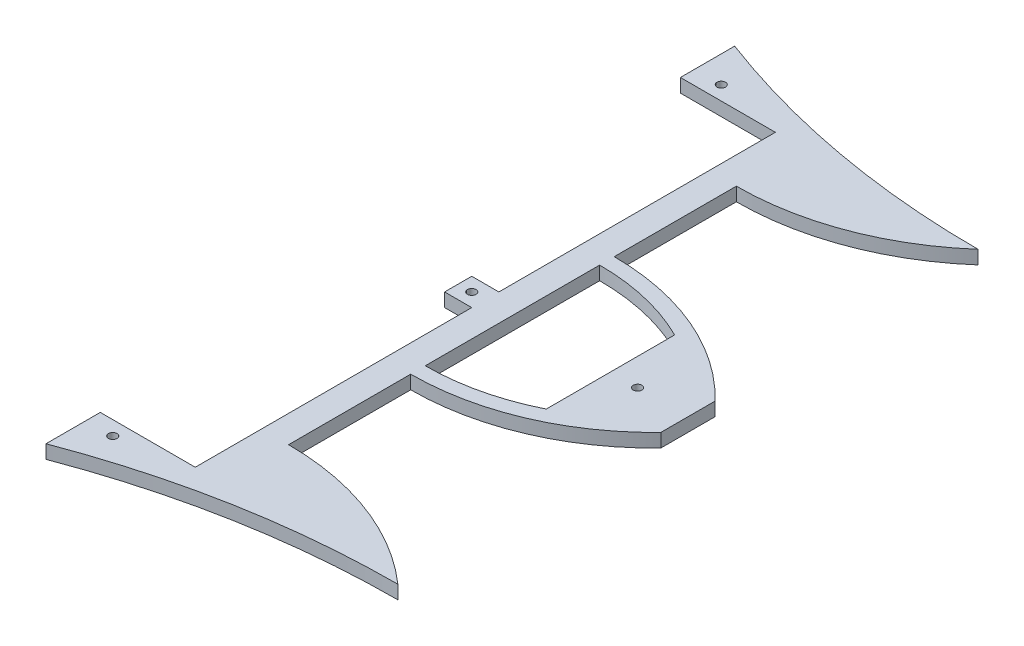
ISO-10303-21;
HEADER;
FILE_DESCRIPTION(('STEP AP214'),'2;1');
FILE_NAME('part.step','',(''),(''),'','','');
FILE_SCHEMA(('AUTOMOTIVE_DESIGN { 1 0 10303 214 1 1 1 1 }'));
ENDSEC;
DATA;
#1=APPLICATION_CONTEXT('core data for automotive mechanical design processes');
#2=APPLICATION_PROTOCOL_DEFINITION('international standard','automotive_design',2000,#1);
#3=PRODUCT_CONTEXT('',#1,'mechanical');
#4=PRODUCT('Part','Part','',(#3));
#5=PRODUCT_RELATED_PRODUCT_CATEGORY('part','',(#4));
#6=PRODUCT_DEFINITION_FORMATION('','',#4);
#7=PRODUCT_DEFINITION_CONTEXT('part definition',#1,'design');
#8=PRODUCT_DEFINITION('design','',#6,#7);
#9=PRODUCT_DEFINITION_SHAPE('','',#8);
#10=(LENGTH_UNIT() NAMED_UNIT(*) SI_UNIT(.MILLI.,.METRE.));
#11=(NAMED_UNIT(*) PLANE_ANGLE_UNIT() SI_UNIT($,.RADIAN.));
#12=(NAMED_UNIT(*) SI_UNIT($,.STERADIAN.) SOLID_ANGLE_UNIT());
#13=UNCERTAINTY_MEASURE_WITH_UNIT(LENGTH_MEASURE(1.E-05),#10,'distance_accuracy_value','');
#14=(GEOMETRIC_REPRESENTATION_CONTEXT(3) GLOBAL_UNCERTAINTY_ASSIGNED_CONTEXT((#13)) GLOBAL_UNIT_ASSIGNED_CONTEXT((#10,
#11,#12)) REPRESENTATION_CONTEXT('',''));
#15=CARTESIAN_POINT('',(0.,0.,0.));
#16=DIRECTION('',(0.,0.,1.));
#17=DIRECTION('',(1.,0.,0.));
#18=AXIS2_PLACEMENT_3D('',#15,#16,#17);
#19=CARTESIAN_POINT('',(0.,6.35,0.));
#20=DIRECTION('',(0.,1.,0.));
#21=DIRECTION('',(0.,0.,1.));
#22=AXIS2_PLACEMENT_3D('',#19,#20,#21);
#23=PLANE('',#22);
#24=CARTESIAN_POINT('',(217.303750699543,6.35,0.));
#25=DIRECTION('',(0.,1.,0.));
#26=DIRECTION('',(0.,0.,1.));
#27=AXIS2_PLACEMENT_3D('',#24,#25,#26);
#28=CIRCLE('',#27,2.);
#29=CARTESIAN_POINT('',(217.303750699543,6.35,1.99999999999991));
#30=VERTEX_POINT('',#29);
#31=EDGE_CURVE('E223',#30,#30,#28,.T.);
#32=ORIENTED_EDGE('',*,*,#31,.F.);
#33=EDGE_LOOP('',(#32));
#34=FACE_BOUND('',#33,.T.);
#35=DIRECTION('',(0.,0.,1.));
#36=VECTOR('',#35,1.);
#37=CARTESIAN_POINT('',(158.75,6.35,-5.39827040751267E-13));
#38=LINE('',#37,#36);
#39=CARTESIAN_POINT('',(158.75,6.35,-40.8111978129983));
#40=VERTEX_POINT('',#39);
#41=CARTESIAN_POINT('',(158.75,6.35,40.8111978129983));
#42=VERTEX_POINT('',#41);
#43=EDGE_CURVE('E258',#40,#42,#38,.T.);
#44=ORIENTED_EDGE('',*,*,#43,.F.);
#45=CARTESIAN_POINT('',(158.75,6.35,62.2275055766957));
#46=DIRECTION('',(0.,1.,0.));
#47=DIRECTION('',(0.,0.,1.));
#48=AXIS2_PLACEMENT_3D('',#45,#46,#47);
#49=CIRCLE('',#48,103.038703389694);
#50=CARTESIAN_POINT('',(204.603750699543,6.35,-30.0460439541071));
#51=VERTEX_POINT('',#50);
#52=EDGE_CURVE('E56',#40,#51,#49,.F.);
#53=ORIENTED_EDGE('',*,*,#52,.T.);
#54=DIRECTION('',(0.,0.,1.));
#55=VECTOR('',#54,1.);
#56=CARTESIAN_POINT('',(204.603750699543,6.35,-2.83509613567922E-13));
#57=LINE('',#56,#55);
#58=CARTESIAN_POINT('',(204.603750699543,6.35,30.046043954107));
#59=VERTEX_POINT('',#58);
#60=EDGE_CURVE('E250',#51,#59,#57,.T.);
#61=ORIENTED_EDGE('',*,*,#60,.T.);
#62=CARTESIAN_POINT('',(158.75,6.35,-62.2275055766968));
#63=DIRECTION('',(0.,1.,0.));
#64=DIRECTION('',(0.,0.,1.));
#65=AXIS2_PLACEMENT_3D('',#62,#63,#64);
#66=CIRCLE('',#65,103.038703389695);
#67=EDGE_CURVE('E261',#42,#59,#66,.T.);
#68=ORIENTED_EDGE('',*,*,#67,.F.);
#69=EDGE_LOOP('',(#44,#53,#61,#68));
#70=FACE_BOUND('',#69,.T.);
#71=CARTESIAN_POINT('',(139.7,6.35,-3.40873163029443E-13));
#72=DIRECTION('',(0.,1.,0.));
#73=DIRECTION('',(0.,0.,1.));
#74=AXIS2_PLACEMENT_3D('',#71,#72,#73);
#75=CIRCLE('',#74,2.);
#76=CARTESIAN_POINT('',(139.7,6.35,1.99999999999966));
#77=VERTEX_POINT('',#76);
#78=EDGE_CURVE('E374',#77,#77,#75,.T.);
#79=ORIENTED_EDGE('',*,*,#78,.F.);
#80=EDGE_LOOP('',(#79));
#81=FACE_BOUND('',#80,.T.);
#82=CARTESIAN_POINT('',(114.080664860715,6.35,-142.38147595269));
#83=DIRECTION('',(0.,1.,0.));
#84=DIRECTION('',(0.,0.,1.));
#85=AXIS2_PLACEMENT_3D('',#82,#83,#84);
#86=CIRCLE('',#85,2.);
#87=CARTESIAN_POINT('',(114.080664860715,6.35,-140.38147595269));
#88=VERTEX_POINT('',#87);
#89=EDGE_CURVE('E305',#88,#88,#86,.T.);
#90=ORIENTED_EDGE('',*,*,#89,.F.);
#91=EDGE_LOOP('',(#90));
#92=FACE_BOUND('',#91,.T.);
#93=CARTESIAN_POINT('',(114.080664860715,6.35,142.38147595269));
#94=DIRECTION('',(0.,-1.,0.));
#95=DIRECTION('',(0.,0.,-1.));
#96=AXIS2_PLACEMENT_3D('',#93,#94,#95);
#97=CIRCLE('',#96,2.);
#98=CARTESIAN_POINT('',(114.080664860715,6.35,140.38147595269));
#99=VERTEX_POINT('',#98);
#100=EDGE_CURVE('E277',#99,#99,#97,.T.);
#101=ORIENTED_EDGE('',*,*,#100,.T.);
#102=EDGE_LOOP('',(#101));
#103=FACE_BOUND('',#102,.T.);
#104=CARTESIAN_POINT('',(158.750000000001,6.35,229.151251741856));
#105=DIRECTION('',(0.,1.,0.));
#106=DIRECTION('',(0.,0.,1.));
#107=AXIS2_PLACEMENT_3D('',#104,#105,#106);
#108=CIRCLE('',#107,124.376251741856);
#109=CARTESIAN_POINT('',(158.750000000001,6.35,104.775));
#110=VERTEX_POINT('',#109);
#111=CARTESIAN_POINT('',(240.876195248116,6.35,135.744934763709));
#112=VERTEX_POINT('',#111);
#113=EDGE_CURVE('E218',#110,#112,#108,.F.);
#114=ORIENTED_EDGE('',*,*,#113,.F.);
#115=DIRECTION('',(0.,0.,1.));
#116=VECTOR('',#115,1.);
#117=CARTESIAN_POINT('',(158.75,6.35,0.));
#118=LINE('',#117,#116);
#119=CARTESIAN_POINT('',(158.75,6.35,47.6249999999999));
#120=VERTEX_POINT('',#119);
#121=EDGE_CURVE('E210',#120,#110,#118,.T.);
#122=ORIENTED_EDGE('',*,*,#121,.F.);
#123=CARTESIAN_POINT('',(158.75,6.35,-66.3974419603674));
#124=DIRECTION('',(0.,1.,0.));
#125=DIRECTION('',(0.,0.,1.));
#126=AXIS2_PLACEMENT_3D('',#123,#124,#125);
#127=CIRCLE('',#126,114.022441960367);
#128=CARTESIAN_POINT('',(240.876195248116,6.35,12.7));
#129=VERTEX_POINT('',#128);
#130=EDGE_CURVE('E213',#120,#129,#127,.T.);
#131=ORIENTED_EDGE('',*,*,#130,.T.);
#132=DIRECTION('',(0.,0.,1.));
#133=VECTOR('',#132,1.);
#134=CARTESIAN_POINT('',(240.876195248116,6.35,1.05285944113608E-12));
#135=LINE('',#134,#133);
#136=CARTESIAN_POINT('',(240.876195248116,6.35,-12.7));
#137=VERTEX_POINT('',#136);
#138=EDGE_CURVE('E346',#137,#129,#135,.T.);
#139=ORIENTED_EDGE('',*,*,#138,.F.);
#140=CARTESIAN_POINT('',(158.75,6.35,66.3974419603674));
#141=DIRECTION('',(0.,1.,0.));
#142=DIRECTION('',(0.,0.,1.));
#143=AXIS2_PLACEMENT_3D('',#140,#141,#142);
#144=CIRCLE('',#143,114.022441960367);
#145=CARTESIAN_POINT('',(158.75,6.35,-47.6249999999999));
#146=VERTEX_POINT('',#145);
#147=EDGE_CURVE('E231',#146,#137,#144,.F.);
#148=ORIENTED_EDGE('',*,*,#147,.F.);
#149=DIRECTION('',(0.,0.,1.));
#150=VECTOR('',#149,1.);
#151=CARTESIAN_POINT('',(158.75,6.35,0.));
#152=LINE('',#151,#150);
#153=CARTESIAN_POINT('',(158.750000000001,6.35,-104.775));
#154=VERTEX_POINT('',#153);
#155=EDGE_CURVE('E348',#154,#146,#152,.T.);
#156=ORIENTED_EDGE('',*,*,#155,.F.);
#157=CARTESIAN_POINT('',(158.750000000001,6.35,-229.151251741856));
#158=DIRECTION('',(0.,1.,0.));
#159=DIRECTION('',(0.,0.,1.));
#160=AXIS2_PLACEMENT_3D('',#157,#158,#159);
#161=CIRCLE('',#160,124.376251741856);
#162=CARTESIAN_POINT('',(240.876195248116,6.35,-135.744934763709));
#163=VERTEX_POINT('',#162);
#164=EDGE_CURVE('E239',#154,#163,#161,.T.);
#165=ORIENTED_EDGE('',*,*,#164,.T.);
#166=CARTESIAN_POINT('',(240.876195248116,6.35,-530.292544267477));
#167=DIRECTION('',(0.,1.,0.));
#168=DIRECTION('',(0.,0.,1.));
#169=AXIS2_PLACEMENT_3D('',#166,#167,#168);
#170=CIRCLE('',#169,394.547609503768);
#171=CARTESIAN_POINT('',(101.6,6.35,-161.144934763709));
#172=VERTEX_POINT('',#171);
#173=EDGE_CURVE('E316',#163,#172,#170,.F.);
#174=ORIENTED_EDGE('',*,*,#173,.T.);
#175=DIRECTION('',(0.,0.,-1.));
#176=VECTOR('',#175,1.);
#177=CARTESIAN_POINT('',(101.6,6.35,0.));
#178=LINE('',#177,#176);
#179=CARTESIAN_POINT('',(101.6,6.35,-135.744934763709));
#180=VERTEX_POINT('',#179);
#181=EDGE_CURVE('E303',#180,#172,#178,.T.);
#182=ORIENTED_EDGE('',*,*,#181,.F.);
#183=DIRECTION('',(-1.,0.,0.));
#184=VECTOR('',#183,1.);
#185=CARTESIAN_POINT('',(0.,6.35,-135.744934763709));
#186=LINE('',#185,#184);
#187=CARTESIAN_POINT('',(146.05,6.35,-135.744934763709));
#188=VERTEX_POINT('',#187);
#189=EDGE_CURVE('E308',#188,#180,#186,.T.);
#190=ORIENTED_EDGE('',*,*,#189,.F.);
#191=DIRECTION('',(0.,0.,-1.));
#192=VECTOR('',#191,1.);
#193=CARTESIAN_POINT('',(146.05,6.35,0.));
#194=LINE('',#193,#192);
#195=CARTESIAN_POINT('',(146.05,6.35,-6.35000000000048));
#196=VERTEX_POINT('',#195);
#197=EDGE_CURVE('E372',#196,#188,#194,.T.);
#198=ORIENTED_EDGE('',*,*,#197,.F.);
#199=DIRECTION('',(1.,0.,0.));
#200=VECTOR('',#199,1.);
#201=CARTESIAN_POINT('',(0.,6.35,-6.35000000000048));
#202=LINE('',#201,#200);
#203=CARTESIAN_POINT('',(133.35,6.35,-6.35000000000048));
#204=VERTEX_POINT('',#203);
#205=EDGE_CURVE('E204',#204,#196,#202,.T.);
#206=ORIENTED_EDGE('',*,*,#205,.F.);
#207=DIRECTION('',(0.,0.,1.));
#208=VECTOR('',#207,1.);
#209=CARTESIAN_POINT('',(133.35,6.35,0.));
#210=LINE('',#209,#208);
#211=CARTESIAN_POINT('',(133.35,6.35,6.34999999999981));
#212=VERTEX_POINT('',#211);
#213=EDGE_CURVE('E325',#204,#212,#210,.T.);
#214=ORIENTED_EDGE('',*,*,#213,.T.);
#215=DIRECTION('',(1.,0.,0.));
#216=VECTOR('',#215,1.);
#217=CARTESIAN_POINT('',(0.,6.35,6.34999999999981));
#218=LINE('',#217,#216);
#219=CARTESIAN_POINT('',(146.05,6.35,6.34999999999981));
#220=VERTEX_POINT('',#219);
#221=EDGE_CURVE('E367',#212,#220,#218,.T.);
#222=ORIENTED_EDGE('',*,*,#221,.T.);
#223=DIRECTION('',(0.,0.,1.));
#224=VECTOR('',#223,1.);
#225=CARTESIAN_POINT('',(146.05,6.35,1.53239693121636E-13));
#226=LINE('',#225,#224);
#227=CARTESIAN_POINT('',(146.05,6.35,135.744934763709));
#228=VERTEX_POINT('',#227);
#229=EDGE_CURVE('E363',#220,#228,#226,.T.);
#230=ORIENTED_EDGE('',*,*,#229,.T.);
#231=DIRECTION('',(1.,0.,0.));
#232=VECTOR('',#231,1.);
#233=CARTESIAN_POINT('',(0.,6.35,135.744934763709));
#234=LINE('',#233,#232);
#235=CARTESIAN_POINT('',(101.6,6.35,135.744934763709));
#236=VERTEX_POINT('',#235);
#237=EDGE_CURVE('E290',#236,#228,#234,.T.);
#238=ORIENTED_EDGE('',*,*,#237,.F.);
#239=DIRECTION('',(0.,0.,1.));
#240=VECTOR('',#239,1.);
#241=CARTESIAN_POINT('',(101.6,6.35,0.));
#242=LINE('',#241,#240);
#243=CARTESIAN_POINT('',(101.6,6.35,161.144934763709));
#244=VERTEX_POINT('',#243);
#245=EDGE_CURVE('E283',#236,#244,#242,.T.);
#246=ORIENTED_EDGE('',*,*,#245,.T.);
#247=CARTESIAN_POINT('',(240.876195248116,6.35,530.292544267477));
#248=DIRECTION('',(0.,1.,0.));
#249=DIRECTION('',(0.,0.,1.));
#250=AXIS2_PLACEMENT_3D('',#247,#248,#249);
#251=CIRCLE('',#250,394.547609503768);
#252=EDGE_CURVE('E285',#112,#244,#251,.T.);
#253=ORIENTED_EDGE('',*,*,#252,.F.);
#254=EDGE_LOOP('',(#114,#122,#131,#139,#148,#156,#165,#174,#182,#190,#198,#206,#214,#222,#230,
#238,#246,#253));
#255=FACE_BOUND('',#254,.T.);
#256=ADVANCED_FACE('F40',(#34,#70,#81,#92,#103,#255),#23,.T.);
#257=CARTESIAN_POINT('',(0.,0.,0.));
#258=DIRECTION('',(0.,1.,0.));
#259=DIRECTION('',(0.,0.,1.));
#260=AXIS2_PLACEMENT_3D('',#257,#258,#259);
#261=PLANE('',#260);
#262=CARTESIAN_POINT('',(217.303750699543,0.,0.));
#263=DIRECTION('',(0.,1.,0.));
#264=DIRECTION('',(0.,0.,1.));
#265=AXIS2_PLACEMENT_3D('',#262,#263,#264);
#266=CIRCLE('',#265,2.);
#267=CARTESIAN_POINT('',(217.303750699543,0.,1.99999999999991));
#268=VERTEX_POINT('',#267);
#269=EDGE_CURVE('E220',#268,#268,#266,.T.);
#270=ORIENTED_EDGE('',*,*,#269,.T.);
#271=EDGE_LOOP('',(#270));
#272=FACE_BOUND('',#271,.T.);
#273=DIRECTION('',(0.,0.,1.));
#274=VECTOR('',#273,1.);
#275=CARTESIAN_POINT('',(158.75,0.,0.));
#276=LINE('',#275,#274);
#277=CARTESIAN_POINT('',(158.75,0.,47.6249999999999));
#278=VERTEX_POINT('',#277);
#279=CARTESIAN_POINT('',(158.750000000001,0.,104.775));
#280=VERTEX_POINT('',#279);
#281=EDGE_CURVE('E192',#278,#280,#276,.T.);
#282=ORIENTED_EDGE('',*,*,#281,.T.);
#283=CARTESIAN_POINT('',(158.750000000001,0.,229.151251741856));
#284=DIRECTION('',(0.,1.,0.));
#285=DIRECTION('',(0.,0.,1.));
#286=AXIS2_PLACEMENT_3D('',#283,#284,#285);
#287=CIRCLE('',#286,124.376251741856);
#288=CARTESIAN_POINT('',(240.876195248116,0.,135.744934763709));
#289=VERTEX_POINT('',#288);
#290=EDGE_CURVE('E197',#280,#289,#287,.F.);
#291=ORIENTED_EDGE('',*,*,#290,.T.);
#292=CARTESIAN_POINT('',(240.876195248116,0.,530.292544267477));
#293=DIRECTION('',(0.,1.,0.));
#294=DIRECTION('',(0.,0.,1.));
#295=AXIS2_PLACEMENT_3D('',#292,#293,#294);
#296=CIRCLE('',#295,394.547609503768);
#297=CARTESIAN_POINT('',(101.6,0.,161.144934763709));
#298=VERTEX_POINT('',#297);
#299=EDGE_CURVE('E287',#289,#298,#296,.T.);
#300=ORIENTED_EDGE('',*,*,#299,.T.);
#301=DIRECTION('',(0.,0.,1.));
#302=VECTOR('',#301,1.);
#303=CARTESIAN_POINT('',(101.6,0.,0.));
#304=LINE('',#303,#302);
#305=CARTESIAN_POINT('',(101.6,0.,135.744934763709));
#306=VERTEX_POINT('',#305);
#307=EDGE_CURVE('E280',#306,#298,#304,.T.);
#308=ORIENTED_EDGE('',*,*,#307,.F.);
#309=DIRECTION('',(1.,0.,0.));
#310=VECTOR('',#309,1.);
#311=CARTESIAN_POINT('',(0.,0.,135.744934763709));
#312=LINE('',#311,#310);
#313=CARTESIAN_POINT('',(146.05,0.,135.744934763709));
#314=VERTEX_POINT('',#313);
#315=EDGE_CURVE('E289',#306,#314,#312,.T.);
#316=ORIENTED_EDGE('',*,*,#315,.T.);
#317=DIRECTION('',(0.,0.,-1.));
#318=VECTOR('',#317,1.);
#319=CARTESIAN_POINT('',(146.05,0.,101.6));
#320=LINE('',#319,#318);
#321=CARTESIAN_POINT('',(146.05,0.,6.34999999999981));
#322=VERTEX_POINT('',#321);
#323=EDGE_CURVE('E44',#314,#322,#320,.T.);
#324=ORIENTED_EDGE('',*,*,#323,.T.);
#325=DIRECTION('',(1.,0.,0.));
#326=VECTOR('',#325,1.);
#327=CARTESIAN_POINT('',(0.,0.,6.34999999999981));
#328=LINE('',#327,#326);
#329=CARTESIAN_POINT('',(133.35,0.,6.34999999999981));
#330=VERTEX_POINT('',#329);
#331=EDGE_CURVE('E334',#330,#322,#328,.T.);
#332=ORIENTED_EDGE('',*,*,#331,.F.);
#333=DIRECTION('',(0.,0.,1.));
#334=VECTOR('',#333,1.);
#335=CARTESIAN_POINT('',(133.35,0.,0.));
#336=LINE('',#335,#334);
#337=CARTESIAN_POINT('',(133.35,0.,-6.35000000000048));
#338=VERTEX_POINT('',#337);
#339=EDGE_CURVE('E331',#338,#330,#336,.T.);
#340=ORIENTED_EDGE('',*,*,#339,.F.);
#341=DIRECTION('',(1.,0.,0.));
#342=VECTOR('',#341,1.);
#343=CARTESIAN_POINT('',(0.,0.,-6.35000000000048));
#344=LINE('',#343,#342);
#345=CARTESIAN_POINT('',(146.05,0.,-6.35000000000048));
#346=VERTEX_POINT('',#345);
#347=EDGE_CURVE('E354',#338,#346,#344,.T.);
#348=ORIENTED_EDGE('',*,*,#347,.T.);
#349=DIRECTION('',(0.,0.,-1.));
#350=VECTOR('',#349,1.);
#351=CARTESIAN_POINT('',(146.05,0.,0.));
#352=LINE('',#351,#350);
#353=CARTESIAN_POINT('',(146.05,0.,-135.744934763709));
#354=VERTEX_POINT('',#353);
#355=EDGE_CURVE('E357',#346,#354,#352,.T.);
#356=ORIENTED_EDGE('',*,*,#355,.T.);
#357=DIRECTION('',(-1.,0.,0.));
#358=VECTOR('',#357,1.);
#359=CARTESIAN_POINT('',(0.,0.,-135.744934763709));
#360=LINE('',#359,#358);
#361=CARTESIAN_POINT('',(101.6,0.,-135.744934763709));
#362=VERTEX_POINT('',#361);
#363=EDGE_CURVE('E313',#354,#362,#360,.T.);
#364=ORIENTED_EDGE('',*,*,#363,.T.);
#365=DIRECTION('',(0.,0.,-1.));
#366=VECTOR('',#365,1.);
#367=CARTESIAN_POINT('',(101.6,0.,0.));
#368=LINE('',#367,#366);
#369=CARTESIAN_POINT('',(101.6,0.,-161.144934763709));
#370=VERTEX_POINT('',#369);
#371=EDGE_CURVE('E300',#362,#370,#368,.T.);
#372=ORIENTED_EDGE('',*,*,#371,.T.);
#373=CARTESIAN_POINT('',(240.876195248116,0.,-530.292544267477));
#374=DIRECTION('',(0.,1.,0.));
#375=DIRECTION('',(0.,0.,1.));
#376=AXIS2_PLACEMENT_3D('',#373,#374,#375);
#377=CIRCLE('',#376,394.547609503768);
#378=CARTESIAN_POINT('',(240.876195248116,0.,-135.744934763709));
#379=VERTEX_POINT('',#378);
#380=EDGE_CURVE('E315',#379,#370,#377,.F.);
#381=ORIENTED_EDGE('',*,*,#380,.F.);
#382=CARTESIAN_POINT('',(158.750000000001,0.,-229.151251741856));
#383=DIRECTION('',(0.,1.,0.));
#384=DIRECTION('',(0.,0.,1.));
#385=AXIS2_PLACEMENT_3D('',#382,#383,#384);
#386=CIRCLE('',#385,124.376251741856);
#387=CARTESIAN_POINT('',(158.750000000001,0.,-104.775));
#388=VERTEX_POINT('',#387);
#389=EDGE_CURVE('E240',#388,#379,#386,.T.);
#390=ORIENTED_EDGE('',*,*,#389,.F.);
#391=DIRECTION('',(0.,0.,1.));
#392=VECTOR('',#391,1.);
#393=CARTESIAN_POINT('',(158.75,0.,0.));
#394=LINE('',#393,#392);
#395=CARTESIAN_POINT('',(158.75,0.,-47.6249999999999));
#396=VERTEX_POINT('',#395);
#397=EDGE_CURVE('E349',#388,#396,#394,.T.);
#398=ORIENTED_EDGE('',*,*,#397,.T.);
#399=CARTESIAN_POINT('',(158.75,0.,66.3974419603674));
#400=DIRECTION('',(0.,1.,0.));
#401=DIRECTION('',(0.,0.,1.));
#402=AXIS2_PLACEMENT_3D('',#399,#400,#401);
#403=CIRCLE('',#402,114.022441960367);
#404=CARTESIAN_POINT('',(240.876195248116,0.,-12.7));
#405=VERTEX_POINT('',#404);
#406=EDGE_CURVE('E232',#396,#405,#403,.F.);
#407=ORIENTED_EDGE('',*,*,#406,.T.);
#408=DIRECTION('',(0.,0.,1.));
#409=VECTOR('',#408,1.);
#410=CARTESIAN_POINT('',(240.876195248116,0.,1.05285944113608E-12));
#411=LINE('',#410,#409);
#412=CARTESIAN_POINT('',(240.876195248116,0.,12.7));
#413=VERTEX_POINT('',#412);
#414=EDGE_CURVE('E205',#405,#413,#411,.T.);
#415=ORIENTED_EDGE('',*,*,#414,.T.);
#416=CARTESIAN_POINT('',(158.75,0.,-66.3974419603674));
#417=DIRECTION('',(0.,1.,0.));
#418=DIRECTION('',(0.,0.,1.));
#419=AXIS2_PLACEMENT_3D('',#416,#417,#418);
#420=CIRCLE('',#419,114.022441960367);
#421=EDGE_CURVE('E200',#278,#413,#420,.T.);
#422=ORIENTED_EDGE('',*,*,#421,.F.);
#423=EDGE_LOOP('',(#282,#291,#300,#308,#316,#324,#332,#340,#348,#356,#364,#372,#381,#390,#398,
#407,#415,#422));
#424=FACE_BOUND('',#423,.T.);
#425=CARTESIAN_POINT('',(114.080664860715,0.,-142.38147595269));
#426=DIRECTION('',(0.,1.,0.));
#427=DIRECTION('',(0.,0.,1.));
#428=AXIS2_PLACEMENT_3D('',#425,#426,#427);
#429=CIRCLE('',#428,2.);
#430=CARTESIAN_POINT('',(114.080664860715,0.,-140.38147595269));
#431=VERTEX_POINT('',#430);
#432=EDGE_CURVE('E299',#431,#431,#429,.T.);
#433=ORIENTED_EDGE('',*,*,#432,.T.);
#434=EDGE_LOOP('',(#433));
#435=FACE_BOUND('',#434,.T.);
#436=CARTESIAN_POINT('',(139.7,0.,-3.40873163029443E-13));
#437=DIRECTION('',(0.,1.,0.));
#438=DIRECTION('',(0.,0.,1.));
#439=AXIS2_PLACEMENT_3D('',#436,#437,#438);
#440=CIRCLE('',#439,2.);
#441=CARTESIAN_POINT('',(139.7,0.,1.99999999999966));
#442=VERTEX_POINT('',#441);
#443=EDGE_CURVE('E366',#442,#442,#440,.T.);
#444=ORIENTED_EDGE('',*,*,#443,.T.);
#445=EDGE_LOOP('',(#444));
#446=FACE_BOUND('',#445,.T.);
#447=CARTESIAN_POINT('',(114.080664860715,0.,142.38147595269));
#448=DIRECTION('',(0.,-1.,0.));
#449=DIRECTION('',(0.,0.,-1.));
#450=AXIS2_PLACEMENT_3D('',#447,#448,#449);
#451=CIRCLE('',#450,2.);
#452=CARTESIAN_POINT('',(114.080664860715,0.,140.38147595269));
#453=VERTEX_POINT('',#452);
#454=EDGE_CURVE('E276',#453,#453,#451,.T.);
#455=ORIENTED_EDGE('',*,*,#454,.F.);
#456=EDGE_LOOP('',(#455));
#457=FACE_BOUND('',#456,.T.);
#458=CARTESIAN_POINT('',(158.75,0.,62.2275055766957));
#459=DIRECTION('',(0.,1.,0.));
#460=DIRECTION('',(0.,0.,1.));
#461=AXIS2_PLACEMENT_3D('',#458,#459,#460);
#462=CIRCLE('',#461,103.038703389694);
#463=CARTESIAN_POINT('',(158.75,0.,-40.8111978129983));
#464=VERTEX_POINT('',#463);
#465=CARTESIAN_POINT('',(204.603750699543,0.,-30.0460439541071));
#466=VERTEX_POINT('',#465);
#467=EDGE_CURVE('E247',#464,#466,#462,.F.);
#468=ORIENTED_EDGE('',*,*,#467,.F.);
#469=DIRECTION('',(0.,0.,1.));
#470=VECTOR('',#469,1.);
#471=CARTESIAN_POINT('',(158.75,0.,-5.39827040751267E-13));
#472=LINE('',#471,#470);
#473=CARTESIAN_POINT('',(158.75,0.,40.8111978129983));
#474=VERTEX_POINT('',#473);
#475=EDGE_CURVE('E249',#464,#474,#472,.T.);
#476=ORIENTED_EDGE('',*,*,#475,.T.);
#477=CARTESIAN_POINT('',(158.75,0.,-62.2275055766968));
#478=DIRECTION('',(0.,1.,0.));
#479=DIRECTION('',(0.,0.,1.));
#480=AXIS2_PLACEMENT_3D('',#477,#478,#479);
#481=CIRCLE('',#480,103.038703389695);
#482=CARTESIAN_POINT('',(204.603750699543,0.,30.046043954107));
#483=VERTEX_POINT('',#482);
#484=EDGE_CURVE('E64',#474,#483,#481,.T.);
#485=ORIENTED_EDGE('',*,*,#484,.T.);
#486=DIRECTION('',(0.,0.,1.));
#487=VECTOR('',#486,1.);
#488=CARTESIAN_POINT('',(204.603750699543,0.,-2.83509613567922E-13));
#489=LINE('',#488,#487);
#490=EDGE_CURVE('E254',#466,#483,#489,.T.);
#491=ORIENTED_EDGE('',*,*,#490,.F.);
#492=EDGE_LOOP('',(#468,#476,#485,#491));
#493=FACE_BOUND('',#492,.T.);
#494=ADVANCED_FACE('F42',(#272,#424,#435,#446,#457,#493),#261,.F.);
#495=CARTESIAN_POINT('',(0.,6.35,-6.35000000000048));
#496=DIRECTION('',(0.,0.,-1.));
#497=DIRECTION('',(-1.,0.,0.));
#498=AXIS2_PLACEMENT_3D('',#495,#496,#497);
#499=PLANE('',#498);
#500=ORIENTED_EDGE('',*,*,#347,.F.);
#501=DIRECTION('',(0.,-1.,0.));
#502=VECTOR('',#501,1.);
#503=CARTESIAN_POINT('',(133.35,6.35,-6.35000000000048));
#504=LINE('',#503,#502);
#505=EDGE_CURVE('E332',#204,#338,#504,.T.);
#506=ORIENTED_EDGE('',*,*,#505,.F.);
#507=ORIENTED_EDGE('',*,*,#205,.T.);
#508=DIRECTION('',(0.,-1.,0.));
#509=VECTOR('',#508,1.);
#510=CARTESIAN_POINT('',(146.05,6.35,-6.35000000000048));
#511=LINE('',#510,#509);
#512=EDGE_CURVE('E329',#196,#346,#511,.T.);
#513=ORIENTED_EDGE('',*,*,#512,.T.);
#514=EDGE_LOOP('',(#500,#506,#507,#513));
#515=FACE_BOUND('',#514,.T.);
#516=ADVANCED_FACE('F406',(#515),#499,.T.);
#517=CARTESIAN_POINT('',(133.35,6.35,0.));
#518=DIRECTION('',(1.,0.,0.));
#519=DIRECTION('',(0.,0.,-1.));
#520=AXIS2_PLACEMENT_3D('',#517,#518,#519);
#521=PLANE('',#520);
#522=ORIENTED_EDGE('',*,*,#339,.T.);
#523=DIRECTION('',(0.,-1.,0.));
#524=VECTOR('',#523,1.);
#525=CARTESIAN_POINT('',(133.35,6.35,6.34999999999981));
#526=LINE('',#525,#524);
#527=EDGE_CURVE('E335',#212,#330,#526,.T.);
#528=ORIENTED_EDGE('',*,*,#527,.F.);
#529=ORIENTED_EDGE('',*,*,#213,.F.);
#530=ORIENTED_EDGE('',*,*,#505,.T.);
#531=EDGE_LOOP('',(#522,#528,#529,#530));
#532=FACE_BOUND('',#531,.T.);
#533=ADVANCED_FACE('F412',(#532),#521,.F.);
#534=CARTESIAN_POINT('',(0.,6.35,6.34999999999981));
#535=DIRECTION('',(0.,0.,-1.));
#536=DIRECTION('',(-1.,0.,0.));
#537=AXIS2_PLACEMENT_3D('',#534,#535,#536);
#538=PLANE('',#537);
#539=ORIENTED_EDGE('',*,*,#331,.T.);
#540=DIRECTION('',(0.,-1.,0.));
#541=VECTOR('',#540,1.);
#542=CARTESIAN_POINT('',(146.05,6.35,6.34999999999981));
#543=LINE('',#542,#541);
#544=EDGE_CURVE('E338',#220,#322,#543,.T.);
#545=ORIENTED_EDGE('',*,*,#544,.F.);
#546=ORIENTED_EDGE('',*,*,#221,.F.);
#547=ORIENTED_EDGE('',*,*,#527,.T.);
#548=EDGE_LOOP('',(#539,#545,#546,#547));
#549=FACE_BOUND('',#548,.T.);
#550=ADVANCED_FACE('F415',(#549),#538,.F.);
#551=CARTESIAN_POINT('',(146.05,6.35,1.53239693121636E-13));
#552=DIRECTION('',(1.,0.,0.));
#553=DIRECTION('',(0.,0.,-1.));
#554=AXIS2_PLACEMENT_3D('',#551,#552,#553);
#555=PLANE('',#554);
#556=ORIENTED_EDGE('',*,*,#544,.T.);
#557=ORIENTED_EDGE('',*,*,#323,.F.);
#558=DIRECTION('',(0.,1.,0.));
#559=VECTOR('',#558,1.);
#560=CARTESIAN_POINT('',(146.05,0.,135.744934763709));
#561=LINE('',#560,#559);
#562=EDGE_CURVE('E12',#314,#228,#561,.T.);
#563=ORIENTED_EDGE('',*,*,#562,.T.);
#564=ORIENTED_EDGE('',*,*,#229,.F.);
#565=EDGE_LOOP('',(#556,#557,#563,#564));
#566=FACE_BOUND('',#565,.T.);
#567=ADVANCED_FACE('F419',(#566),#555,.F.);
#568=CARTESIAN_POINT('',(158.75,6.35,0.));
#569=DIRECTION('',(1.,0.,0.));
#570=DIRECTION('',(0.,0.,-1.));
#571=AXIS2_PLACEMENT_3D('',#568,#569,#570);
#572=PLANE('',#571);
#573=ORIENTED_EDGE('',*,*,#281,.F.);
#574=DIRECTION('',(0.,1.,0.));
#575=VECTOR('',#574,1.);
#576=CARTESIAN_POINT('',(158.75,0.,47.6249999999999));
#577=LINE('',#576,#575);
#578=EDGE_CURVE('E227',#278,#120,#577,.T.);
#579=ORIENTED_EDGE('',*,*,#578,.T.);
#580=ORIENTED_EDGE('',*,*,#121,.T.);
#581=DIRECTION('',(0.,1.,0.));
#582=VECTOR('',#581,1.);
#583=CARTESIAN_POINT('',(158.750000000001,0.,104.775));
#584=LINE('',#583,#582);
#585=EDGE_CURVE('E208',#280,#110,#584,.T.);
#586=ORIENTED_EDGE('',*,*,#585,.F.);
#587=EDGE_LOOP('',(#573,#579,#580,#586));
#588=FACE_BOUND('',#587,.T.);
#589=ADVANCED_FACE('F209',(#588),#572,.T.);
#590=CARTESIAN_POINT('',(240.876195248116,6.35,1.05285944113608E-12));
#591=DIRECTION('',(1.,0.,0.));
#592=DIRECTION('',(0.,0.,-1.));
#593=AXIS2_PLACEMENT_3D('',#590,#591,#592);
#594=PLANE('',#593);
#595=ORIENTED_EDGE('',*,*,#414,.F.);
#596=DIRECTION('',(0.,-1.,0.));
#597=VECTOR('',#596,1.);
#598=CARTESIAN_POINT('',(240.876195248116,6.35,-12.7));
#599=LINE('',#598,#597);
#600=EDGE_CURVE('E345',#137,#405,#599,.T.);
#601=ORIENTED_EDGE('',*,*,#600,.F.);
#602=ORIENTED_EDGE('',*,*,#138,.T.);
#603=DIRECTION('',(0.,-1.,0.));
#604=VECTOR('',#603,1.);
#605=CARTESIAN_POINT('',(240.876195248116,6.35,12.7));
#606=LINE('',#605,#604);
#607=EDGE_CURVE('E342',#129,#413,#606,.T.);
#608=ORIENTED_EDGE('',*,*,#607,.T.);
#609=EDGE_LOOP('',(#595,#601,#602,#608));
#610=FACE_BOUND('',#609,.T.);
#611=ADVANCED_FACE('F437',(#610),#594,.T.);
#612=CARTESIAN_POINT('',(158.75,6.35,0.));
#613=DIRECTION('',(1.,0.,0.));
#614=DIRECTION('',(0.,0.,-1.));
#615=AXIS2_PLACEMENT_3D('',#612,#613,#614);
#616=PLANE('',#615);
#617=ORIENTED_EDGE('',*,*,#397,.F.);
#618=DIRECTION('',(0.,1.,0.));
#619=VECTOR('',#618,1.);
#620=CARTESIAN_POINT('',(158.750000000001,0.,-104.775));
#621=LINE('',#620,#619);
#622=EDGE_CURVE('E242',#388,#154,#621,.T.);
#623=ORIENTED_EDGE('',*,*,#622,.T.);
#624=ORIENTED_EDGE('',*,*,#155,.T.);
#625=DIRECTION('',(0.,1.,0.));
#626=VECTOR('',#625,1.);
#627=CARTESIAN_POINT('',(158.75,0.,-47.6249999999999));
#628=LINE('',#627,#626);
#629=EDGE_CURVE('E235',#396,#146,#628,.T.);
#630=ORIENTED_EDGE('',*,*,#629,.F.);
#631=EDGE_LOOP('',(#617,#623,#624,#630));
#632=FACE_BOUND('',#631,.T.);
#633=ADVANCED_FACE('F447',(#632),#616,.T.);
#634=CARTESIAN_POINT('',(139.7,0.,-3.40873163029443E-13));
#635=DIRECTION('',(0.,1.,0.));
#636=DIRECTION('',(0.,0.,1.));
#637=AXIS2_PLACEMENT_3D('',#634,#635,#636);
#638=CYLINDRICAL_SURFACE('',#637,2.);
#639=ORIENTED_EDGE('',*,*,#443,.F.);
#640=EDGE_LOOP('',(#639));
#641=FACE_BOUND('',#640,.T.);
#642=ORIENTED_EDGE('',*,*,#78,.T.);
#643=EDGE_LOOP('',(#642));
#644=FACE_BOUND('',#643,.T.);
#645=ADVANCED_FACE('F471',(#641,#644),#638,.F.);
#646=CARTESIAN_POINT('',(146.05,6.35,0.));
#647=DIRECTION('',(-1.,0.,0.));
#648=DIRECTION('',(0.,0.,1.));
#649=AXIS2_PLACEMENT_3D('',#646,#647,#648);
#650=PLANE('',#649);
#651=ORIENTED_EDGE('',*,*,#355,.F.);
#652=ORIENTED_EDGE('',*,*,#512,.F.);
#653=ORIENTED_EDGE('',*,*,#197,.T.);
#654=DIRECTION('',(0.,1.,0.));
#655=VECTOR('',#654,1.);
#656=CARTESIAN_POINT('',(146.05,0.,-135.744934763709));
#657=LINE('',#656,#655);
#658=EDGE_CURVE('E328',#354,#188,#657,.T.);
#659=ORIENTED_EDGE('',*,*,#658,.F.);
#660=EDGE_LOOP('',(#651,#652,#653,#659));
#661=FACE_BOUND('',#660,.T.);
#662=ADVANCED_FACE('F404',(#661),#650,.T.);
#663=CARTESIAN_POINT('',(0.,0.,-135.744934763709));
#664=DIRECTION('',(0.,0.,-1.));
#665=DIRECTION('',(-1.,0.,0.));
#666=AXIS2_PLACEMENT_3D('',#663,#664,#665);
#667=PLANE('',#666);
#668=ORIENTED_EDGE('',*,*,#658,.T.);
#669=ORIENTED_EDGE('',*,*,#189,.T.);
#670=DIRECTION('',(0.,1.,0.));
#671=VECTOR('',#670,1.);
#672=CARTESIAN_POINT('',(101.6,0.,-135.744934763709));
#673=LINE('',#672,#671);
#674=EDGE_CURVE('E302',#362,#180,#673,.T.);
#675=ORIENTED_EDGE('',*,*,#674,.F.);
#676=ORIENTED_EDGE('',*,*,#363,.F.);
#677=EDGE_LOOP('',(#668,#669,#675,#676));
#678=FACE_BOUND('',#677,.T.);
#679=ADVANCED_FACE('F385',(#678),#667,.F.);
#680=CARTESIAN_POINT('',(240.876195248116,0.,-530.292544267477));
#681=DIRECTION('',(0.,1.,0.));
#682=DIRECTION('',(0.,0.,1.));
#683=AXIS2_PLACEMENT_3D('',#680,#681,#682);
#684=CYLINDRICAL_SURFACE('',#683,394.547609503768);
#685=ORIENTED_EDGE('',*,*,#173,.F.);
#686=DIRECTION('',(0.,-1.,0.));
#687=VECTOR('',#686,1.);
#688=CARTESIAN_POINT('',(240.876195248116,6.35,-135.744934763709));
#689=LINE('',#688,#687);
#690=EDGE_CURVE('E49',#163,#379,#689,.T.);
#691=ORIENTED_EDGE('',*,*,#690,.T.);
#692=ORIENTED_EDGE('',*,*,#380,.T.);
#693=DIRECTION('',(0.,1.,0.));
#694=VECTOR('',#693,1.);
#695=CARTESIAN_POINT('',(101.6,0.,-161.144934763709));
#696=LINE('',#695,#694);
#697=EDGE_CURVE('E319',#370,#172,#696,.T.);
#698=ORIENTED_EDGE('',*,*,#697,.T.);
#699=EDGE_LOOP('',(#685,#691,#692,#698));
#700=FACE_BOUND('',#699,.T.);
#701=ADVANCED_FACE('F399',(#700),#684,.F.);
#702=CARTESIAN_POINT('',(101.6,6.35,0.));
#703=DIRECTION('',(-1.,0.,0.));
#704=DIRECTION('',(0.,0.,1.));
#705=AXIS2_PLACEMENT_3D('',#702,#703,#704);
#706=PLANE('',#705);
#707=ORIENTED_EDGE('',*,*,#674,.T.);
#708=ORIENTED_EDGE('',*,*,#181,.T.);
#709=ORIENTED_EDGE('',*,*,#697,.F.);
#710=ORIENTED_EDGE('',*,*,#371,.F.);
#711=EDGE_LOOP('',(#707,#708,#709,#710));
#712=FACE_BOUND('',#711,.T.);
#713=ADVANCED_FACE('F396',(#712),#706,.T.);
#714=CARTESIAN_POINT('',(114.080664860715,0.,-142.38147595269));
#715=DIRECTION('',(0.,1.,0.));
#716=DIRECTION('',(0.,0.,1.));
#717=AXIS2_PLACEMENT_3D('',#714,#715,#716);
#718=CYLINDRICAL_SURFACE('',#717,2.);
#719=ORIENTED_EDGE('',*,*,#432,.F.);
#720=EDGE_LOOP('',(#719));
#721=FACE_BOUND('',#720,.T.);
#722=ORIENTED_EDGE('',*,*,#89,.T.);
#723=EDGE_LOOP('',(#722));
#724=FACE_BOUND('',#723,.T.);
#725=ADVANCED_FACE('F495',(#721,#724),#718,.F.);
#726=CARTESIAN_POINT('',(0.,0.,135.744934763709));
#727=DIRECTION('',(0.,0.,1.));
#728=DIRECTION('',(1.,0.,0.));
#729=AXIS2_PLACEMENT_3D('',#726,#727,#728);
#730=PLANE('',#729);
#731=ORIENTED_EDGE('',*,*,#237,.T.);
#732=ORIENTED_EDGE('',*,*,#562,.F.);
#733=ORIENTED_EDGE('',*,*,#315,.F.);
#734=DIRECTION('',(0.,1.,0.));
#735=VECTOR('',#734,1.);
#736=CARTESIAN_POINT('',(101.6,0.,135.744934763709));
#737=LINE('',#736,#735);
#738=EDGE_CURVE('E268',#306,#236,#737,.T.);
#739=ORIENTED_EDGE('',*,*,#738,.T.);
#740=EDGE_LOOP('',(#731,#732,#733,#739));
#741=FACE_BOUND('',#740,.T.);
#742=ADVANCED_FACE('F424',(#741),#730,.F.);
#743=CARTESIAN_POINT('',(240.876195248116,0.,530.292544267477));
#744=DIRECTION('',(0.,1.,0.));
#745=DIRECTION('',(0.,0.,1.));
#746=AXIS2_PLACEMENT_3D('',#743,#744,#745);
#747=CYLINDRICAL_SURFACE('',#746,394.547609503768);
#748=ORIENTED_EDGE('',*,*,#252,.T.);
#749=DIRECTION('',(0.,1.,0.));
#750=VECTOR('',#749,1.);
#751=CARTESIAN_POINT('',(101.6,0.,161.144934763709));
#752=LINE('',#751,#750);
#753=EDGE_CURVE('E293',#298,#244,#752,.T.);
#754=ORIENTED_EDGE('',*,*,#753,.F.);
#755=ORIENTED_EDGE('',*,*,#299,.F.);
#756=DIRECTION('',(0.,-1.,0.));
#757=VECTOR('',#756,1.);
#758=CARTESIAN_POINT('',(240.876195248116,6.35,135.744934763709));
#759=LINE('',#758,#757);
#760=EDGE_CURVE('E217',#112,#289,#759,.T.);
#761=ORIENTED_EDGE('',*,*,#760,.F.);
#762=EDGE_LOOP('',(#748,#754,#755,#761));
#763=FACE_BOUND('',#762,.T.);
#764=ADVANCED_FACE('F430',(#763),#747,.F.);
#765=CARTESIAN_POINT('',(114.080664860715,0.,142.38147595269));
#766=DIRECTION('',(0.,1.,0.));
#767=DIRECTION('',(0.,0.,1.));
#768=AXIS2_PLACEMENT_3D('',#765,#766,#767);
#769=CYLINDRICAL_SURFACE('',#768,2.);
#770=ORIENTED_EDGE('',*,*,#454,.T.);
#771=EDGE_LOOP('',(#770));
#772=FACE_BOUND('',#771,.T.);
#773=ORIENTED_EDGE('',*,*,#100,.F.);
#774=EDGE_LOOP('',(#773));
#775=FACE_BOUND('',#774,.T.);
#776=ADVANCED_FACE('F503',(#772,#775),#769,.F.);
#777=CARTESIAN_POINT('',(101.6,6.35,0.));
#778=DIRECTION('',(1.,0.,0.));
#779=DIRECTION('',(0.,0.,-1.));
#780=AXIS2_PLACEMENT_3D('',#777,#778,#779);
#781=PLANE('',#780);
#782=ORIENTED_EDGE('',*,*,#245,.F.);
#783=ORIENTED_EDGE('',*,*,#738,.F.);
#784=ORIENTED_EDGE('',*,*,#307,.T.);
#785=ORIENTED_EDGE('',*,*,#753,.T.);
#786=EDGE_LOOP('',(#782,#783,#784,#785));
#787=FACE_BOUND('',#786,.T.);
#788=ADVANCED_FACE('F427',(#787),#781,.F.);
#789=CARTESIAN_POINT('',(158.75,0.,62.2275055766957));
#790=DIRECTION('',(0.,1.,0.));
#791=DIRECTION('',(0.,0.,1.));
#792=AXIS2_PLACEMENT_3D('',#789,#790,#791);
#793=CYLINDRICAL_SURFACE('',#792,103.038703389694);
#794=ORIENTED_EDGE('',*,*,#52,.F.);
#795=DIRECTION('',(0.,1.,0.));
#796=VECTOR('',#795,1.);
#797=CARTESIAN_POINT('',(158.75,0.,-40.8111978129983));
#798=LINE('',#797,#796);
#799=EDGE_CURVE('E256',#464,#40,#798,.T.);
#800=ORIENTED_EDGE('',*,*,#799,.F.);
#801=ORIENTED_EDGE('',*,*,#467,.T.);
#802=DIRECTION('',(0.,1.,0.));
#803=VECTOR('',#802,1.);
#804=CARTESIAN_POINT('',(204.603750699543,0.,-30.0460439541071));
#805=LINE('',#804,#803);
#806=EDGE_CURVE('E266',#466,#51,#805,.T.);
#807=ORIENTED_EDGE('',*,*,#806,.T.);
#808=EDGE_LOOP('',(#794,#800,#801,#807));
#809=FACE_BOUND('',#808,.T.);
#810=ADVANCED_FACE('F508',(#809),#793,.F.);
#811=CARTESIAN_POINT('',(204.603750699543,0.,-2.83509613567922E-13));
#812=DIRECTION('',(-1.,0.,0.));
#813=DIRECTION('',(0.,0.,1.));
#814=AXIS2_PLACEMENT_3D('',#811,#812,#813);
#815=PLANE('',#814);
#816=ORIENTED_EDGE('',*,*,#60,.F.);
#817=ORIENTED_EDGE('',*,*,#806,.F.);
#818=ORIENTED_EDGE('',*,*,#490,.T.);
#819=DIRECTION('',(0.,1.,0.));
#820=VECTOR('',#819,1.);
#821=CARTESIAN_POINT('',(204.603750699543,0.,30.046043954107));
#822=LINE('',#821,#820);
#823=EDGE_CURVE('E269',#483,#59,#822,.T.);
#824=ORIENTED_EDGE('',*,*,#823,.T.);
#825=EDGE_LOOP('',(#816,#817,#818,#824));
#826=FACE_BOUND('',#825,.T.);
#827=ADVANCED_FACE('F513',(#826),#815,.T.);
#828=CARTESIAN_POINT('',(158.75,0.,-62.2275055766968));
#829=DIRECTION('',(0.,1.,0.));
#830=DIRECTION('',(0.,0.,1.));
#831=AXIS2_PLACEMENT_3D('',#828,#829,#830);
#832=CYLINDRICAL_SURFACE('',#831,103.038703389695);
#833=ORIENTED_EDGE('',*,*,#67,.T.);
#834=ORIENTED_EDGE('',*,*,#823,.F.);
#835=ORIENTED_EDGE('',*,*,#484,.F.);
#836=DIRECTION('',(0.,1.,0.));
#837=VECTOR('',#836,1.);
#838=CARTESIAN_POINT('',(158.75,0.,40.8111978129983));
#839=LINE('',#838,#837);
#840=EDGE_CURVE('E271',#474,#42,#839,.T.);
#841=ORIENTED_EDGE('',*,*,#840,.T.);
#842=EDGE_LOOP('',(#833,#834,#835,#841));
#843=FACE_BOUND('',#842,.T.);
#844=ADVANCED_FACE('F458',(#843),#832,.F.);
#845=CARTESIAN_POINT('',(158.75,0.,-5.39827040751267E-13));
#846=DIRECTION('',(-1.,0.,0.));
#847=DIRECTION('',(0.,0.,1.));
#848=AXIS2_PLACEMENT_3D('',#845,#846,#847);
#849=PLANE('',#848);
#850=ORIENTED_EDGE('',*,*,#43,.T.);
#851=ORIENTED_EDGE('',*,*,#840,.F.);
#852=ORIENTED_EDGE('',*,*,#475,.F.);
#853=ORIENTED_EDGE('',*,*,#799,.T.);
#854=EDGE_LOOP('',(#850,#851,#852,#853));
#855=FACE_BOUND('',#854,.T.);
#856=ADVANCED_FACE('F451',(#855),#849,.F.);
#857=CARTESIAN_POINT('',(158.750000000001,0.,-229.151251741856));
#858=DIRECTION('',(0.,1.,0.));
#859=DIRECTION('',(0.,0.,1.));
#860=AXIS2_PLACEMENT_3D('',#857,#858,#859);
#861=CYLINDRICAL_SURFACE('',#860,124.376251741856);
#862=ORIENTED_EDGE('',*,*,#164,.F.);
#863=ORIENTED_EDGE('',*,*,#622,.F.);
#864=ORIENTED_EDGE('',*,*,#389,.T.);
#865=ORIENTED_EDGE('',*,*,#690,.F.);
#866=EDGE_LOOP('',(#862,#863,#864,#865));
#867=FACE_BOUND('',#866,.T.);
#868=ADVANCED_FACE('F449',(#867),#861,.T.);
#869=CARTESIAN_POINT('',(158.75,0.,66.3974419603674));
#870=DIRECTION('',(0.,1.,0.));
#871=DIRECTION('',(0.,0.,1.));
#872=AXIS2_PLACEMENT_3D('',#869,#870,#871);
#873=CYLINDRICAL_SURFACE('',#872,114.022441960367);
#874=ORIENTED_EDGE('',*,*,#147,.T.);
#875=ORIENTED_EDGE('',*,*,#600,.T.);
#876=ORIENTED_EDGE('',*,*,#406,.F.);
#877=ORIENTED_EDGE('',*,*,#629,.T.);
#878=EDGE_LOOP('',(#874,#875,#876,#877));
#879=FACE_BOUND('',#878,.T.);
#880=ADVANCED_FACE('F442',(#879),#873,.T.);
#881=CARTESIAN_POINT('',(158.75,0.,-66.3974419603674));
#882=DIRECTION('',(0.,1.,0.));
#883=DIRECTION('',(0.,0.,1.));
#884=AXIS2_PLACEMENT_3D('',#881,#882,#883);
#885=CYLINDRICAL_SURFACE('',#884,114.022441960367);
#886=ORIENTED_EDGE('',*,*,#130,.F.);
#887=ORIENTED_EDGE('',*,*,#578,.F.);
#888=ORIENTED_EDGE('',*,*,#421,.T.);
#889=ORIENTED_EDGE('',*,*,#607,.F.);
#890=EDGE_LOOP('',(#886,#887,#888,#889));
#891=FACE_BOUND('',#890,.T.);
#892=ADVANCED_FACE('F434',(#891),#885,.T.);
#893=CARTESIAN_POINT('',(158.750000000001,0.,229.151251741856));
#894=DIRECTION('',(0.,1.,0.));
#895=DIRECTION('',(0.,0.,1.));
#896=AXIS2_PLACEMENT_3D('',#893,#894,#895);
#897=CYLINDRICAL_SURFACE('',#896,124.376251741856);
#898=ORIENTED_EDGE('',*,*,#113,.T.);
#899=ORIENTED_EDGE('',*,*,#760,.T.);
#900=ORIENTED_EDGE('',*,*,#290,.F.);
#901=ORIENTED_EDGE('',*,*,#585,.T.);
#902=EDGE_LOOP('',(#898,#899,#900,#901));
#903=FACE_BOUND('',#902,.T.);
#904=ADVANCED_FACE('F215',(#903),#897,.T.);
#905=CARTESIAN_POINT('',(217.303750699543,0.,0.));
#906=DIRECTION('',(0.,1.,0.));
#907=DIRECTION('',(0.,0.,1.));
#908=AXIS2_PLACEMENT_3D('',#905,#906,#907);
#909=CYLINDRICAL_SURFACE('',#908,2.);
#910=ORIENTED_EDGE('',*,*,#269,.F.);
#911=EDGE_LOOP('',(#910));
#912=FACE_BOUND('',#911,.T.);
#913=ORIENTED_EDGE('',*,*,#31,.T.);
#914=EDGE_LOOP('',(#913));
#915=FACE_BOUND('',#914,.T.);
#916=ADVANCED_FACE('F611',(#912,#915),#909,.F.);
#917=CLOSED_SHELL('',(#256,#494,#516,#533,#550,#567,#589,#611,#633,#645,#662,#679,#701,#713,
#725,#742,#764,#776,#788,#810,#827,#844,#856,#868,#880,#892,#904,#916));
#918=MANIFOLD_SOLID_BREP('B2',#917);
#919=ADVANCED_BREP_SHAPE_REPRESENTATION('',(#18,#918),#14);
#920=SHAPE_DEFINITION_REPRESENTATION(#9,#919);
ENDSEC;
END-ISO-10303-21;
